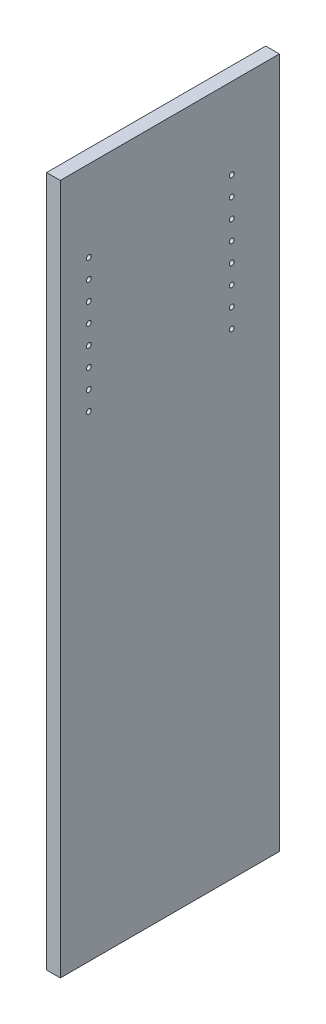
ISO-10303-21;
HEADER;
FILE_DESCRIPTION(('STEP AP214'),'2;1');
FILE_NAME('part.step','',(''),(''),'','','');
FILE_SCHEMA(('AUTOMOTIVE_DESIGN { 1 0 10303 214 1 1 1 1 }'));
ENDSEC;
DATA;
#1=APPLICATION_CONTEXT('core data for automotive mechanical design processes');
#2=APPLICATION_PROTOCOL_DEFINITION('international standard','automotive_design',2000,#1);
#3=PRODUCT_CONTEXT('',#1,'mechanical');
#4=PRODUCT('Part','Part','',(#3));
#5=PRODUCT_RELATED_PRODUCT_CATEGORY('part','',(#4));
#6=PRODUCT_DEFINITION_FORMATION('','',#4);
#7=PRODUCT_DEFINITION_CONTEXT('part definition',#1,'design');
#8=PRODUCT_DEFINITION('design','',#6,#7);
#9=PRODUCT_DEFINITION_SHAPE('','',#8);
#10=(LENGTH_UNIT() NAMED_UNIT(*) SI_UNIT(.MILLI.,.METRE.));
#11=(NAMED_UNIT(*) PLANE_ANGLE_UNIT() SI_UNIT($,.RADIAN.));
#12=(NAMED_UNIT(*) SI_UNIT($,.STERADIAN.) SOLID_ANGLE_UNIT());
#13=UNCERTAINTY_MEASURE_WITH_UNIT(LENGTH_MEASURE(1.E-05),#10,'distance_accuracy_value','');
#14=(GEOMETRIC_REPRESENTATION_CONTEXT(3) GLOBAL_UNCERTAINTY_ASSIGNED_CONTEXT((#13)) GLOBAL_UNIT_ASSIGNED_CONTEXT((#10,
#11,#12)) REPRESENTATION_CONTEXT('',''));
#15=CARTESIAN_POINT('',(0.,0.,0.));
#16=DIRECTION('',(0.,0.,1.));
#17=DIRECTION('',(1.,0.,0.));
#18=AXIS2_PLACEMENT_3D('',#15,#16,#17);
#19=CARTESIAN_POINT('',(18.25625,-460.375,-146.05));
#20=DIRECTION('',(0.,0.,1.));
#21=DIRECTION('',(1.,0.,0.));
#22=AXIS2_PLACEMENT_3D('',#19,#20,#21);
#23=PLANE('',#22);
#24=DIRECTION('',(0.,1.,0.));
#25=VECTOR('',#24,1.);
#26=CARTESIAN_POINT('',(0.,-460.375,-146.05));
#27=LINE('',#26,#25);
#28=CARTESIAN_POINT('',(0.,-460.375,-146.05));
#29=VERTEX_POINT('',#28);
#30=CARTESIAN_POINT('',(0.,460.375,-146.05));
#31=VERTEX_POINT('',#30);
#32=EDGE_CURVE('E107',#29,#31,#27,.T.);
#33=ORIENTED_EDGE('',*,*,#32,.T.);
#34=DIRECTION('',(-1.,0.,0.));
#35=VECTOR('',#34,1.);
#36=CARTESIAN_POINT('',(18.25625,460.375,-146.05));
#37=LINE('',#36,#35);
#38=CARTESIAN_POINT('',(18.25625,460.375,-146.05));
#39=VERTEX_POINT('',#38);
#40=EDGE_CURVE('E11',#39,#31,#37,.T.);
#41=ORIENTED_EDGE('',*,*,#40,.F.);
#42=DIRECTION('',(0.,1.,0.));
#43=VECTOR('',#42,1.);
#44=CARTESIAN_POINT('',(18.25625,-460.375,-146.05));
#45=LINE('',#44,#43);
#46=CARTESIAN_POINT('',(18.25625,-460.375,-146.05));
#47=VERTEX_POINT('',#46);
#48=EDGE_CURVE('E91',#47,#39,#45,.T.);
#49=ORIENTED_EDGE('',*,*,#48,.F.);
#50=DIRECTION('',(-1.,0.,0.));
#51=VECTOR('',#50,1.);
#52=CARTESIAN_POINT('',(18.25625,-460.375,-146.05));
#53=LINE('',#52,#51);
#54=EDGE_CURVE('E103',#47,#29,#53,.T.);
#55=ORIENTED_EDGE('',*,*,#54,.T.);
#56=EDGE_LOOP('',(#33,#41,#49,#55));
#57=FACE_BOUND('',#56,.T.);
#58=ADVANCED_FACE('F39',(#57),#23,.F.);
#59=CARTESIAN_POINT('',(18.25625,460.375,146.05));
#60=DIRECTION('',(0.,-1.,0.));
#61=DIRECTION('',(0.,0.,-1.));
#62=AXIS2_PLACEMENT_3D('',#59,#60,#61);
#63=PLANE('',#62);
#64=DIRECTION('',(0.,0.,1.));
#65=VECTOR('',#64,1.);
#66=CARTESIAN_POINT('',(0.,460.375,146.05));
#67=LINE('',#66,#65);
#68=CARTESIAN_POINT('',(0.,460.375,146.05));
#69=VERTEX_POINT('',#68);
#70=EDGE_CURVE('E96',#31,#69,#67,.T.);
#71=ORIENTED_EDGE('',*,*,#70,.T.);
#72=DIRECTION('',(-1.,0.,0.));
#73=VECTOR('',#72,1.);
#74=CARTESIAN_POINT('',(18.25625,460.375,146.05));
#75=LINE('',#74,#73);
#76=CARTESIAN_POINT('',(18.25625,460.375,146.05));
#77=VERTEX_POINT('',#76);
#78=EDGE_CURVE('E48',#77,#69,#75,.T.);
#79=ORIENTED_EDGE('',*,*,#78,.F.);
#80=DIRECTION('',(0.,0.,1.));
#81=VECTOR('',#80,1.);
#82=CARTESIAN_POINT('',(18.25625,460.375,146.05));
#83=LINE('',#82,#81);
#84=EDGE_CURVE('E86',#39,#77,#83,.T.);
#85=ORIENTED_EDGE('',*,*,#84,.F.);
#86=ORIENTED_EDGE('',*,*,#40,.T.);
#87=EDGE_LOOP('',(#71,#79,#85,#86));
#88=FACE_BOUND('',#87,.T.);
#89=ADVANCED_FACE('F95',(#88),#63,.F.);
#90=CARTESIAN_POINT('',(18.25625,-460.375,146.05));
#91=DIRECTION('',(0.,0.,-1.));
#92=DIRECTION('',(-1.,0.,0.));
#93=AXIS2_PLACEMENT_3D('',#90,#91,#92);
#94=PLANE('',#93);
#95=DIRECTION('',(0.,-1.,0.));
#96=VECTOR('',#95,1.);
#97=CARTESIAN_POINT('',(0.,-460.375,146.05));
#98=LINE('',#97,#96);
#99=CARTESIAN_POINT('',(0.,-460.375,146.05));
#100=VERTEX_POINT('',#99);
#101=EDGE_CURVE('E73',#69,#100,#98,.T.);
#102=ORIENTED_EDGE('',*,*,#101,.T.);
#103=DIRECTION('',(-1.,0.,0.));
#104=VECTOR('',#103,1.);
#105=CARTESIAN_POINT('',(18.25625,-460.375,146.05));
#106=LINE('',#105,#104);
#107=CARTESIAN_POINT('',(18.25625,-460.375,146.05));
#108=VERTEX_POINT('',#107);
#109=EDGE_CURVE('E98',#108,#100,#106,.T.);
#110=ORIENTED_EDGE('',*,*,#109,.F.);
#111=DIRECTION('',(0.,-1.,0.));
#112=VECTOR('',#111,1.);
#113=CARTESIAN_POINT('',(18.25625,-460.375,146.05));
#114=LINE('',#113,#112);
#115=EDGE_CURVE('E89',#77,#108,#114,.T.);
#116=ORIENTED_EDGE('',*,*,#115,.F.);
#117=ORIENTED_EDGE('',*,*,#78,.T.);
#118=EDGE_LOOP('',(#102,#110,#116,#117));
#119=FACE_BOUND('',#118,.T.);
#120=ADVANCED_FACE('F99',(#119),#94,.F.);
#121=CARTESIAN_POINT('',(18.25625,-460.375,146.05));
#122=DIRECTION('',(0.,1.,0.));
#123=DIRECTION('',(0.,0.,1.));
#124=AXIS2_PLACEMENT_3D('',#121,#122,#123);
#125=PLANE('',#124);
#126=DIRECTION('',(0.,0.,-1.));
#127=VECTOR('',#126,1.);
#128=CARTESIAN_POINT('',(0.,-460.375,146.05));
#129=LINE('',#128,#127);
#130=EDGE_CURVE('E79',#100,#29,#129,.T.);
#131=ORIENTED_EDGE('',*,*,#130,.T.);
#132=ORIENTED_EDGE('',*,*,#54,.F.);
#133=DIRECTION('',(0.,0.,-1.));
#134=VECTOR('',#133,1.);
#135=CARTESIAN_POINT('',(18.25625,-460.375,146.05));
#136=LINE('',#135,#134);
#137=EDGE_CURVE('E56',#108,#47,#136,.T.);
#138=ORIENTED_EDGE('',*,*,#137,.F.);
#139=ORIENTED_EDGE('',*,*,#109,.T.);
#140=EDGE_LOOP('',(#131,#132,#138,#139));
#141=FACE_BOUND('',#140,.T.);
#142=ADVANCED_FACE('F121',(#141),#125,.F.);
#143=CARTESIAN_POINT('',(18.25625,0.,0.));
#144=DIRECTION('',(-1.,0.,0.));
#145=DIRECTION('',(0.,0.,1.));
#146=AXIS2_PLACEMENT_3D('',#143,#144,#145);
#147=PLANE('',#146);
#148=CARTESIAN_POINT('',(18.25625,327.025,107.95));
#149=DIRECTION('',(1.,0.,0.));
#150=DIRECTION('',(0.,0.,-1.));
#151=AXIS2_PLACEMENT_3D('',#148,#149,#150);
#152=CIRCLE('',#151,3.175);
#153=CARTESIAN_POINT('',(18.25625,327.025,104.775));
#154=VERTEX_POINT('',#153);
#155=EDGE_CURVE('E193',#154,#154,#152,.T.);
#156=ORIENTED_EDGE('',*,*,#155,.F.);
#157=EDGE_LOOP('',(#156));
#158=FACE_BOUND('',#157,.T.);
#159=CARTESIAN_POINT('',(18.25625,301.625,107.949999999999));
#160=DIRECTION('',(1.,0.,0.));
#161=DIRECTION('',(0.,0.,-1.));
#162=AXIS2_PLACEMENT_3D('',#159,#160,#161);
#163=CIRCLE('',#162,3.175);
#164=CARTESIAN_POINT('',(18.25625,301.625,104.774999999999));
#165=VERTEX_POINT('',#164);
#166=EDGE_CURVE('E185',#165,#165,#163,.T.);
#167=ORIENTED_EDGE('',*,*,#166,.F.);
#168=EDGE_LOOP('',(#167));
#169=FACE_BOUND('',#168,.T.);
#170=CARTESIAN_POINT('',(18.25625,276.225,107.949999999999));
#171=DIRECTION('',(1.,0.,0.));
#172=DIRECTION('',(0.,0.,-1.));
#173=AXIS2_PLACEMENT_3D('',#170,#171,#172);
#174=CIRCLE('',#173,3.175);
#175=CARTESIAN_POINT('',(18.25625,276.225,104.774999999999));
#176=VERTEX_POINT('',#175);
#177=EDGE_CURVE('E177',#176,#176,#174,.T.);
#178=ORIENTED_EDGE('',*,*,#177,.F.);
#179=EDGE_LOOP('',(#178));
#180=FACE_BOUND('',#179,.T.);
#181=CARTESIAN_POINT('',(18.25625,250.825,107.949999999999));
#182=DIRECTION('',(1.,0.,0.));
#183=DIRECTION('',(0.,0.,-1.));
#184=AXIS2_PLACEMENT_3D('',#181,#182,#183);
#185=CIRCLE('',#184,3.175);
#186=CARTESIAN_POINT('',(18.25625,250.825,104.774999999999));
#187=VERTEX_POINT('',#186);
#188=EDGE_CURVE('E169',#187,#187,#185,.T.);
#189=ORIENTED_EDGE('',*,*,#188,.F.);
#190=EDGE_LOOP('',(#189));
#191=FACE_BOUND('',#190,.T.);
#192=CARTESIAN_POINT('',(18.25625,225.425,107.949999999999));
#193=DIRECTION('',(1.,0.,0.));
#194=DIRECTION('',(0.,0.,-1.));
#195=AXIS2_PLACEMENT_3D('',#192,#193,#194);
#196=CIRCLE('',#195,3.175);
#197=CARTESIAN_POINT('',(18.25625,225.425,104.774999999999));
#198=VERTEX_POINT('',#197);
#199=EDGE_CURVE('E161',#198,#198,#196,.T.);
#200=ORIENTED_EDGE('',*,*,#199,.F.);
#201=EDGE_LOOP('',(#200));
#202=FACE_BOUND('',#201,.T.);
#203=CARTESIAN_POINT('',(18.25625,200.025,107.949999999998));
#204=DIRECTION('',(1.,0.,0.));
#205=DIRECTION('',(0.,0.,-1.));
#206=AXIS2_PLACEMENT_3D('',#203,#204,#205);
#207=CIRCLE('',#206,3.175);
#208=CARTESIAN_POINT('',(18.25625,200.025,104.774999999998));
#209=VERTEX_POINT('',#208);
#210=EDGE_CURVE('E153',#209,#209,#207,.T.);
#211=ORIENTED_EDGE('',*,*,#210,.F.);
#212=EDGE_LOOP('',(#211));
#213=FACE_BOUND('',#212,.T.);
#214=CARTESIAN_POINT('',(18.25625,174.625,107.949999999998));
#215=DIRECTION('',(1.,0.,0.));
#216=DIRECTION('',(0.,0.,-1.));
#217=AXIS2_PLACEMENT_3D('',#214,#215,#216);
#218=CIRCLE('',#217,3.175);
#219=CARTESIAN_POINT('',(18.25625,174.625,104.774999999998));
#220=VERTEX_POINT('',#219);
#221=EDGE_CURVE('E145',#220,#220,#218,.T.);
#222=ORIENTED_EDGE('',*,*,#221,.F.);
#223=EDGE_LOOP('',(#222));
#224=FACE_BOUND('',#223,.T.);
#225=CARTESIAN_POINT('',(18.25625,174.625,-82.5499999999981));
#226=DIRECTION('',(1.,0.,0.));
#227=DIRECTION('',(0.,0.,1.));
#228=AXIS2_PLACEMENT_3D('',#225,#226,#227);
#229=CIRCLE('',#228,3.175);
#230=CARTESIAN_POINT('',(18.25625,174.625,-79.3749999999981));
#231=VERTEX_POINT('',#230);
#232=EDGE_CURVE('E136',#231,#231,#229,.T.);
#233=ORIENTED_EDGE('',*,*,#232,.F.);
#234=EDGE_LOOP('',(#233));
#235=FACE_BOUND('',#234,.T.);
#236=CARTESIAN_POINT('',(18.25625,200.025,-82.5499999999983));
#237=DIRECTION('',(1.,0.,0.));
#238=DIRECTION('',(0.,0.,1.));
#239=AXIS2_PLACEMENT_3D('',#236,#237,#238);
#240=CIRCLE('',#239,3.175);
#241=CARTESIAN_POINT('',(18.25625,200.025,-79.3749999999983));
#242=VERTEX_POINT('',#241);
#243=EDGE_CURVE('E248',#242,#242,#240,.T.);
#244=ORIENTED_EDGE('',*,*,#243,.F.);
#245=EDGE_LOOP('',(#244));
#246=FACE_BOUND('',#245,.T.);
#247=CARTESIAN_POINT('',(18.25625,225.425,-82.5499999999986));
#248=DIRECTION('',(1.,0.,0.));
#249=DIRECTION('',(0.,0.,1.));
#250=AXIS2_PLACEMENT_3D('',#247,#248,#249);
#251=CIRCLE('',#250,3.175);
#252=CARTESIAN_POINT('',(18.25625,225.425,-79.3749999999986));
#253=VERTEX_POINT('',#252);
#254=EDGE_CURVE('E240',#253,#253,#251,.T.);
#255=ORIENTED_EDGE('',*,*,#254,.F.);
#256=EDGE_LOOP('',(#255));
#257=FACE_BOUND('',#256,.T.);
#258=CARTESIAN_POINT('',(18.25625,250.825,-82.5499999999988));
#259=DIRECTION('',(1.,0.,0.));
#260=DIRECTION('',(0.,0.,1.));
#261=AXIS2_PLACEMENT_3D('',#258,#259,#260);
#262=CIRCLE('',#261,3.175);
#263=CARTESIAN_POINT('',(18.25625,250.825,-79.3749999999988));
#264=VERTEX_POINT('',#263);
#265=EDGE_CURVE('E232',#264,#264,#262,.T.);
#266=ORIENTED_EDGE('',*,*,#265,.F.);
#267=EDGE_LOOP('',(#266));
#268=FACE_BOUND('',#267,.T.);
#269=CARTESIAN_POINT('',(18.25625,276.225,-82.5499999999991));
#270=DIRECTION('',(1.,0.,0.));
#271=DIRECTION('',(0.,0.,1.));
#272=AXIS2_PLACEMENT_3D('',#269,#270,#271);
#273=CIRCLE('',#272,3.175);
#274=CARTESIAN_POINT('',(18.25625,276.225,-79.3749999999991));
#275=VERTEX_POINT('',#274);
#276=EDGE_CURVE('E224',#275,#275,#273,.T.);
#277=ORIENTED_EDGE('',*,*,#276,.F.);
#278=EDGE_LOOP('',(#277));
#279=FACE_BOUND('',#278,.T.);
#280=CARTESIAN_POINT('',(18.25625,301.625,-82.5499999999993));
#281=DIRECTION('',(1.,0.,0.));
#282=DIRECTION('',(0.,0.,1.));
#283=AXIS2_PLACEMENT_3D('',#280,#281,#282);
#284=CIRCLE('',#283,3.175);
#285=CARTESIAN_POINT('',(18.25625,301.625,-79.3749999999993));
#286=VERTEX_POINT('',#285);
#287=EDGE_CURVE('E216',#286,#286,#284,.T.);
#288=ORIENTED_EDGE('',*,*,#287,.F.);
#289=EDGE_LOOP('',(#288));
#290=FACE_BOUND('',#289,.T.);
#291=CARTESIAN_POINT('',(18.25625,327.025,-82.5499999999996));
#292=DIRECTION('',(1.,0.,0.));
#293=DIRECTION('',(0.,0.,1.));
#294=AXIS2_PLACEMENT_3D('',#291,#292,#293);
#295=CIRCLE('',#294,3.175);
#296=CARTESIAN_POINT('',(18.25625,327.025,-79.3749999999996));
#297=VERTEX_POINT('',#296);
#298=EDGE_CURVE('E208',#297,#297,#295,.T.);
#299=ORIENTED_EDGE('',*,*,#298,.F.);
#300=EDGE_LOOP('',(#299));
#301=FACE_BOUND('',#300,.T.);
#302=CARTESIAN_POINT('',(18.25625,352.425,-82.5499999999999));
#303=DIRECTION('',(1.,0.,0.));
#304=DIRECTION('',(0.,0.,1.));
#305=AXIS2_PLACEMENT_3D('',#302,#303,#304);
#306=CIRCLE('',#305,3.175);
#307=CARTESIAN_POINT('',(18.25625,352.425,-79.3749999999999));
#308=VERTEX_POINT('',#307);
#309=EDGE_CURVE('E200',#308,#308,#306,.T.);
#310=ORIENTED_EDGE('',*,*,#309,.F.);
#311=EDGE_LOOP('',(#310));
#312=FACE_BOUND('',#311,.T.);
#313=CARTESIAN_POINT('',(18.25625,352.425,107.95));
#314=DIRECTION('',(1.,0.,0.));
#315=DIRECTION('',(0.,0.,-1.));
#316=AXIS2_PLACEMENT_3D('',#313,#314,#315);
#317=CIRCLE('',#316,3.175);
#318=CARTESIAN_POINT('',(18.25625,352.425,104.775));
#319=VERTEX_POINT('',#318);
#320=EDGE_CURVE('E128',#319,#319,#317,.T.);
#321=ORIENTED_EDGE('',*,*,#320,.F.);
#322=EDGE_LOOP('',(#321));
#323=FACE_BOUND('',#322,.T.);
#324=ORIENTED_EDGE('',*,*,#48,.T.);
#325=ORIENTED_EDGE('',*,*,#84,.T.);
#326=ORIENTED_EDGE('',*,*,#115,.T.);
#327=ORIENTED_EDGE('',*,*,#137,.T.);
#328=EDGE_LOOP('',(#324,#325,#326,#327));
#329=FACE_BOUND('',#328,.T.);
#330=ADVANCED_FACE('F87',(#158,#169,#180,#191,#202,#213,#224,#235,#246,#257,#268,#279,#290,#301,
#312,#323,#329),#147,.F.);
#331=CARTESIAN_POINT('',(0.,0.,0.));
#332=DIRECTION('',(-1.,0.,0.));
#333=DIRECTION('',(0.,0.,1.));
#334=AXIS2_PLACEMENT_3D('',#331,#332,#333);
#335=PLANE('',#334);
#336=ORIENTED_EDGE('',*,*,#32,.F.);
#337=ORIENTED_EDGE('',*,*,#130,.F.);
#338=ORIENTED_EDGE('',*,*,#101,.F.);
#339=ORIENTED_EDGE('',*,*,#70,.F.);
#340=EDGE_LOOP('',(#336,#337,#338,#339));
#341=FACE_BOUND('',#340,.T.);
#342=ADVANCED_FACE('F124',(#341),#335,.T.);
#343=CARTESIAN_POINT('',(8.73125,352.425,107.95));
#344=DIRECTION('',(1.,0.,0.));
#345=DIRECTION('',(0.,0.,-1.));
#346=AXIS2_PLACEMENT_3D('',#343,#344,#345);
#347=CYLINDRICAL_SURFACE('',#346,3.175);
#348=CARTESIAN_POINT('',(8.73125,352.425,107.95));
#349=DIRECTION('',(1.,0.,0.));
#350=DIRECTION('',(0.,0.,-1.));
#351=AXIS2_PLACEMENT_3D('',#348,#349,#350);
#352=CIRCLE('',#351,3.175);
#353=CARTESIAN_POINT('',(8.73125,352.425,104.775));
#354=VERTEX_POINT('',#353);
#355=EDGE_CURVE('E111',#354,#354,#352,.T.);
#356=ORIENTED_EDGE('',*,*,#355,.F.);
#357=EDGE_LOOP('',(#356));
#358=FACE_BOUND('',#357,.T.);
#359=ORIENTED_EDGE('',*,*,#320,.T.);
#360=EDGE_LOOP('',(#359));
#361=FACE_BOUND('',#360,.T.);
#362=ADVANCED_FACE('F283',(#358,#361),#347,.F.);
#363=CARTESIAN_POINT('',(8.73125,352.425,107.95));
#364=DIRECTION('',(1.,0.,0.));
#365=DIRECTION('',(0.,0.,-1.));
#366=AXIS2_PLACEMENT_3D('',#363,#364,#365);
#367=PLANE('',#366);
#368=ORIENTED_EDGE('',*,*,#355,.T.);
#369=EDGE_LOOP('',(#368));
#370=FACE_BOUND('',#369,.T.);
#371=ADVANCED_FACE('F285',(#370),#367,.T.);
#372=CARTESIAN_POINT('',(8.73125,352.425,-82.5499999999999));
#373=DIRECTION('',(1.,0.,0.));
#374=DIRECTION('',(0.,0.,-1.));
#375=AXIS2_PLACEMENT_3D('',#372,#373,#374);
#376=CYLINDRICAL_SURFACE('',#375,3.175);
#377=CARTESIAN_POINT('',(8.73125,352.425,-82.5499999999999));
#378=DIRECTION('',(1.,0.,0.));
#379=DIRECTION('',(0.,0.,1.));
#380=AXIS2_PLACEMENT_3D('',#377,#378,#379);
#381=CIRCLE('',#380,3.175);
#382=CARTESIAN_POINT('',(8.73125,352.425,-79.3749999999999));
#383=VERTEX_POINT('',#382);
#384=EDGE_CURVE('E204',#383,#383,#381,.T.);
#385=ORIENTED_EDGE('',*,*,#384,.F.);
#386=EDGE_LOOP('',(#385));
#387=FACE_BOUND('',#386,.T.);
#388=ORIENTED_EDGE('',*,*,#309,.T.);
#389=EDGE_LOOP('',(#388));
#390=FACE_BOUND('',#389,.T.);
#391=ADVANCED_FACE('F292',(#387,#390),#376,.F.);
#392=CARTESIAN_POINT('',(8.73125,352.425,-82.5499999999999));
#393=DIRECTION('',(-1.,0.,0.));
#394=DIRECTION('',(0.,0.,1.));
#395=AXIS2_PLACEMENT_3D('',#392,#393,#394);
#396=PLANE('',#395);
#397=ORIENTED_EDGE('',*,*,#384,.T.);
#398=EDGE_LOOP('',(#397));
#399=FACE_BOUND('',#398,.T.);
#400=ADVANCED_FACE('F340',(#399),#396,.F.);
#401=CARTESIAN_POINT('',(8.73125,327.025,-82.5499999999996));
#402=DIRECTION('',(1.,0.,0.));
#403=DIRECTION('',(0.,0.,-1.));
#404=AXIS2_PLACEMENT_3D('',#401,#402,#403);
#405=CYLINDRICAL_SURFACE('',#404,3.175);
#406=CARTESIAN_POINT('',(8.73125,327.025,-82.5499999999996));
#407=DIRECTION('',(1.,0.,0.));
#408=DIRECTION('',(0.,0.,1.));
#409=AXIS2_PLACEMENT_3D('',#406,#407,#408);
#410=CIRCLE('',#409,3.175);
#411=CARTESIAN_POINT('',(8.73125,327.025,-79.3749999999996));
#412=VERTEX_POINT('',#411);
#413=EDGE_CURVE('E212',#412,#412,#410,.T.);
#414=ORIENTED_EDGE('',*,*,#413,.F.);
#415=EDGE_LOOP('',(#414));
#416=FACE_BOUND('',#415,.T.);
#417=ORIENTED_EDGE('',*,*,#298,.T.);
#418=EDGE_LOOP('',(#417));
#419=FACE_BOUND('',#418,.T.);
#420=ADVANCED_FACE('F349',(#416,#419),#405,.F.);
#421=CARTESIAN_POINT('',(8.73125,327.025,-82.5499999999996));
#422=DIRECTION('',(-1.,0.,0.));
#423=DIRECTION('',(0.,0.,1.));
#424=AXIS2_PLACEMENT_3D('',#421,#422,#423);
#425=PLANE('',#424);
#426=ORIENTED_EDGE('',*,*,#413,.T.);
#427=EDGE_LOOP('',(#426));
#428=FACE_BOUND('',#427,.T.);
#429=ADVANCED_FACE('F358',(#428),#425,.F.);
#430=CARTESIAN_POINT('',(8.73125,301.625,-82.5499999999993));
#431=DIRECTION('',(1.,0.,0.));
#432=DIRECTION('',(0.,0.,-1.));
#433=AXIS2_PLACEMENT_3D('',#430,#431,#432);
#434=CYLINDRICAL_SURFACE('',#433,3.175);
#435=CARTESIAN_POINT('',(8.73125,301.625,-82.5499999999993));
#436=DIRECTION('',(1.,0.,0.));
#437=DIRECTION('',(0.,0.,1.));
#438=AXIS2_PLACEMENT_3D('',#435,#436,#437);
#439=CIRCLE('',#438,3.175);
#440=CARTESIAN_POINT('',(8.73125,301.625,-79.3749999999993));
#441=VERTEX_POINT('',#440);
#442=EDGE_CURVE('E220',#441,#441,#439,.T.);
#443=ORIENTED_EDGE('',*,*,#442,.F.);
#444=EDGE_LOOP('',(#443));
#445=FACE_BOUND('',#444,.T.);
#446=ORIENTED_EDGE('',*,*,#287,.T.);
#447=EDGE_LOOP('',(#446));
#448=FACE_BOUND('',#447,.T.);
#449=ADVANCED_FACE('F367',(#445,#448),#434,.F.);
#450=CARTESIAN_POINT('',(8.73125,301.625,-82.5499999999993));
#451=DIRECTION('',(-1.,0.,0.));
#452=DIRECTION('',(0.,0.,1.));
#453=AXIS2_PLACEMENT_3D('',#450,#451,#452);
#454=PLANE('',#453);
#455=ORIENTED_EDGE('',*,*,#442,.T.);
#456=EDGE_LOOP('',(#455));
#457=FACE_BOUND('',#456,.T.);
#458=ADVANCED_FACE('F376',(#457),#454,.F.);
#459=CARTESIAN_POINT('',(8.73125,276.225,-82.5499999999991));
#460=DIRECTION('',(1.,0.,0.));
#461=DIRECTION('',(0.,0.,-1.));
#462=AXIS2_PLACEMENT_3D('',#459,#460,#461);
#463=CYLINDRICAL_SURFACE('',#462,3.175);
#464=CARTESIAN_POINT('',(8.73125,276.225,-82.5499999999991));
#465=DIRECTION('',(1.,0.,0.));
#466=DIRECTION('',(0.,0.,1.));
#467=AXIS2_PLACEMENT_3D('',#464,#465,#466);
#468=CIRCLE('',#467,3.175);
#469=CARTESIAN_POINT('',(8.73125,276.225,-79.3749999999991));
#470=VERTEX_POINT('',#469);
#471=EDGE_CURVE('E228',#470,#470,#468,.T.);
#472=ORIENTED_EDGE('',*,*,#471,.F.);
#473=EDGE_LOOP('',(#472));
#474=FACE_BOUND('',#473,.T.);
#475=ORIENTED_EDGE('',*,*,#276,.T.);
#476=EDGE_LOOP('',(#475));
#477=FACE_BOUND('',#476,.T.);
#478=ADVANCED_FACE('F385',(#474,#477),#463,.F.);
#479=CARTESIAN_POINT('',(8.73125,276.225,-82.5499999999991));
#480=DIRECTION('',(-1.,0.,0.));
#481=DIRECTION('',(0.,0.,1.));
#482=AXIS2_PLACEMENT_3D('',#479,#480,#481);
#483=PLANE('',#482);
#484=ORIENTED_EDGE('',*,*,#471,.T.);
#485=EDGE_LOOP('',(#484));
#486=FACE_BOUND('',#485,.T.);
#487=ADVANCED_FACE('F394',(#486),#483,.F.);
#488=CARTESIAN_POINT('',(8.73125,250.825,-82.5499999999988));
#489=DIRECTION('',(1.,0.,0.));
#490=DIRECTION('',(0.,0.,-1.));
#491=AXIS2_PLACEMENT_3D('',#488,#489,#490);
#492=CYLINDRICAL_SURFACE('',#491,3.175);
#493=CARTESIAN_POINT('',(8.73125,250.825,-82.5499999999988));
#494=DIRECTION('',(1.,0.,0.));
#495=DIRECTION('',(0.,0.,1.));
#496=AXIS2_PLACEMENT_3D('',#493,#494,#495);
#497=CIRCLE('',#496,3.175);
#498=CARTESIAN_POINT('',(8.73125,250.825,-79.3749999999988));
#499=VERTEX_POINT('',#498);
#500=EDGE_CURVE('E236',#499,#499,#497,.T.);
#501=ORIENTED_EDGE('',*,*,#500,.F.);
#502=EDGE_LOOP('',(#501));
#503=FACE_BOUND('',#502,.T.);
#504=ORIENTED_EDGE('',*,*,#265,.T.);
#505=EDGE_LOOP('',(#504));
#506=FACE_BOUND('',#505,.T.);
#507=ADVANCED_FACE('F403',(#503,#506),#492,.F.);
#508=CARTESIAN_POINT('',(8.73125,250.825,-82.5499999999988));
#509=DIRECTION('',(-1.,0.,0.));
#510=DIRECTION('',(0.,0.,1.));
#511=AXIS2_PLACEMENT_3D('',#508,#509,#510);
#512=PLANE('',#511);
#513=ORIENTED_EDGE('',*,*,#500,.T.);
#514=EDGE_LOOP('',(#513));
#515=FACE_BOUND('',#514,.T.);
#516=ADVANCED_FACE('F412',(#515),#512,.F.);
#517=CARTESIAN_POINT('',(8.73125,225.425,-82.5499999999986));
#518=DIRECTION('',(1.,0.,0.));
#519=DIRECTION('',(0.,0.,-1.));
#520=AXIS2_PLACEMENT_3D('',#517,#518,#519);
#521=CYLINDRICAL_SURFACE('',#520,3.175);
#522=CARTESIAN_POINT('',(8.73125,225.425,-82.5499999999986));
#523=DIRECTION('',(1.,0.,0.));
#524=DIRECTION('',(0.,0.,1.));
#525=AXIS2_PLACEMENT_3D('',#522,#523,#524);
#526=CIRCLE('',#525,3.175);
#527=CARTESIAN_POINT('',(8.73125,225.425,-79.3749999999986));
#528=VERTEX_POINT('',#527);
#529=EDGE_CURVE('E244',#528,#528,#526,.T.);
#530=ORIENTED_EDGE('',*,*,#529,.F.);
#531=EDGE_LOOP('',(#530));
#532=FACE_BOUND('',#531,.T.);
#533=ORIENTED_EDGE('',*,*,#254,.T.);
#534=EDGE_LOOP('',(#533));
#535=FACE_BOUND('',#534,.T.);
#536=ADVANCED_FACE('F421',(#532,#535),#521,.F.);
#537=CARTESIAN_POINT('',(8.73125,225.425,-82.5499999999986));
#538=DIRECTION('',(-1.,0.,0.));
#539=DIRECTION('',(0.,0.,1.));
#540=AXIS2_PLACEMENT_3D('',#537,#538,#539);
#541=PLANE('',#540);
#542=ORIENTED_EDGE('',*,*,#529,.T.);
#543=EDGE_LOOP('',(#542));
#544=FACE_BOUND('',#543,.T.);
#545=ADVANCED_FACE('F261',(#544),#541,.F.);
#546=CARTESIAN_POINT('',(8.73125,200.025,-82.5499999999983));
#547=DIRECTION('',(1.,0.,0.));
#548=DIRECTION('',(0.,0.,-1.));
#549=AXIS2_PLACEMENT_3D('',#546,#547,#548);
#550=CYLINDRICAL_SURFACE('',#549,3.175);
#551=CARTESIAN_POINT('',(8.73125,200.025,-82.5499999999983));
#552=DIRECTION('',(1.,0.,0.));
#553=DIRECTION('',(0.,0.,1.));
#554=AXIS2_PLACEMENT_3D('',#551,#552,#553);
#555=CIRCLE('',#554,3.175);
#556=CARTESIAN_POINT('',(8.73125,200.025,-79.3749999999983));
#557=VERTEX_POINT('',#556);
#558=EDGE_CURVE('E141',#557,#557,#555,.T.);
#559=ORIENTED_EDGE('',*,*,#558,.F.);
#560=EDGE_LOOP('',(#559));
#561=FACE_BOUND('',#560,.T.);
#562=ORIENTED_EDGE('',*,*,#243,.T.);
#563=EDGE_LOOP('',(#562));
#564=FACE_BOUND('',#563,.T.);
#565=ADVANCED_FACE('F258',(#561,#564),#550,.F.);
#566=CARTESIAN_POINT('',(8.73125,200.025,-82.5499999999983));
#567=DIRECTION('',(-1.,0.,0.));
#568=DIRECTION('',(0.,0.,1.));
#569=AXIS2_PLACEMENT_3D('',#566,#567,#568);
#570=PLANE('',#569);
#571=ORIENTED_EDGE('',*,*,#558,.T.);
#572=EDGE_LOOP('',(#571));
#573=FACE_BOUND('',#572,.T.);
#574=ADVANCED_FACE('F256',(#573),#570,.F.);
#575=CARTESIAN_POINT('',(8.73125,174.625,-82.5499999999981));
#576=DIRECTION('',(1.,0.,0.));
#577=DIRECTION('',(0.,0.,-1.));
#578=AXIS2_PLACEMENT_3D('',#575,#576,#577);
#579=CYLINDRICAL_SURFACE('',#578,3.175);
#580=CARTESIAN_POINT('',(8.73125,174.625,-82.5499999999981));
#581=DIRECTION('',(1.,0.,0.));
#582=DIRECTION('',(0.,0.,1.));
#583=AXIS2_PLACEMENT_3D('',#580,#581,#582);
#584=CIRCLE('',#583,3.175);
#585=CARTESIAN_POINT('',(8.73125,174.625,-79.3749999999981));
#586=VERTEX_POINT('',#585);
#587=EDGE_CURVE('E140',#586,#586,#584,.T.);
#588=ORIENTED_EDGE('',*,*,#587,.F.);
#589=EDGE_LOOP('',(#588));
#590=FACE_BOUND('',#589,.T.);
#591=ORIENTED_EDGE('',*,*,#232,.T.);
#592=EDGE_LOOP('',(#591));
#593=FACE_BOUND('',#592,.T.);
#594=ADVANCED_FACE('F451',(#590,#593),#579,.F.);
#595=CARTESIAN_POINT('',(8.73125,174.625,-82.5499999999981));
#596=DIRECTION('',(-1.,0.,0.));
#597=DIRECTION('',(0.,0.,1.));
#598=AXIS2_PLACEMENT_3D('',#595,#596,#597);
#599=PLANE('',#598);
#600=ORIENTED_EDGE('',*,*,#587,.T.);
#601=EDGE_LOOP('',(#600));
#602=FACE_BOUND('',#601,.T.);
#603=ADVANCED_FACE('F459',(#602),#599,.F.);
#604=CARTESIAN_POINT('',(8.73125,174.625,107.949999999998));
#605=DIRECTION('',(1.,0.,0.));
#606=DIRECTION('',(0.,0.,-1.));
#607=AXIS2_PLACEMENT_3D('',#604,#605,#606);
#608=CYLINDRICAL_SURFACE('',#607,3.175);
#609=CARTESIAN_POINT('',(8.73125,174.625,107.949999999998));
#610=DIRECTION('',(1.,0.,0.));
#611=DIRECTION('',(0.,0.,-1.));
#612=AXIS2_PLACEMENT_3D('',#609,#610,#611);
#613=CIRCLE('',#612,3.175);
#614=CARTESIAN_POINT('',(8.73125,174.625,104.774999999998));
#615=VERTEX_POINT('',#614);
#616=EDGE_CURVE('E149',#615,#615,#613,.T.);
#617=ORIENTED_EDGE('',*,*,#616,.F.);
#618=EDGE_LOOP('',(#617));
#619=FACE_BOUND('',#618,.T.);
#620=ORIENTED_EDGE('',*,*,#221,.T.);
#621=EDGE_LOOP('',(#620));
#622=FACE_BOUND('',#621,.T.);
#623=ADVANCED_FACE('F468',(#619,#622),#608,.F.);
#624=CARTESIAN_POINT('',(8.73125,174.625,107.949999999998));
#625=DIRECTION('',(1.,0.,0.));
#626=DIRECTION('',(0.,0.,-1.));
#627=AXIS2_PLACEMENT_3D('',#624,#625,#626);
#628=PLANE('',#627);
#629=ORIENTED_EDGE('',*,*,#616,.T.);
#630=EDGE_LOOP('',(#629));
#631=FACE_BOUND('',#630,.T.);
#632=ADVANCED_FACE('F477',(#631),#628,.T.);
#633=CARTESIAN_POINT('',(8.73125,200.025,107.949999999998));
#634=DIRECTION('',(1.,0.,0.));
#635=DIRECTION('',(0.,0.,-1.));
#636=AXIS2_PLACEMENT_3D('',#633,#634,#635);
#637=CYLINDRICAL_SURFACE('',#636,3.175);
#638=CARTESIAN_POINT('',(8.73125,200.025,107.949999999998));
#639=DIRECTION('',(1.,0.,0.));
#640=DIRECTION('',(0.,0.,-1.));
#641=AXIS2_PLACEMENT_3D('',#638,#639,#640);
#642=CIRCLE('',#641,3.175);
#643=CARTESIAN_POINT('',(8.73125,200.025,104.774999999998));
#644=VERTEX_POINT('',#643);
#645=EDGE_CURVE('E157',#644,#644,#642,.T.);
#646=ORIENTED_EDGE('',*,*,#645,.F.);
#647=EDGE_LOOP('',(#646));
#648=FACE_BOUND('',#647,.T.);
#649=ORIENTED_EDGE('',*,*,#210,.T.);
#650=EDGE_LOOP('',(#649));
#651=FACE_BOUND('',#650,.T.);
#652=ADVANCED_FACE('F486',(#648,#651),#637,.F.);
#653=CARTESIAN_POINT('',(8.73125,200.025,107.949999999998));
#654=DIRECTION('',(1.,0.,0.));
#655=DIRECTION('',(0.,0.,-1.));
#656=AXIS2_PLACEMENT_3D('',#653,#654,#655);
#657=PLANE('',#656);
#658=ORIENTED_EDGE('',*,*,#645,.T.);
#659=EDGE_LOOP('',(#658));
#660=FACE_BOUND('',#659,.T.);
#661=ADVANCED_FACE('F495',(#660),#657,.T.);
#662=CARTESIAN_POINT('',(8.73125,225.425,107.949999999999));
#663=DIRECTION('',(1.,0.,0.));
#664=DIRECTION('',(0.,0.,-1.));
#665=AXIS2_PLACEMENT_3D('',#662,#663,#664);
#666=CYLINDRICAL_SURFACE('',#665,3.175);
#667=CARTESIAN_POINT('',(8.73125,225.425,107.949999999999));
#668=DIRECTION('',(1.,0.,0.));
#669=DIRECTION('',(0.,0.,-1.));
#670=AXIS2_PLACEMENT_3D('',#667,#668,#669);
#671=CIRCLE('',#670,3.175);
#672=CARTESIAN_POINT('',(8.73125,225.425,104.774999999999));
#673=VERTEX_POINT('',#672);
#674=EDGE_CURVE('E165',#673,#673,#671,.T.);
#675=ORIENTED_EDGE('',*,*,#674,.F.);
#676=EDGE_LOOP('',(#675));
#677=FACE_BOUND('',#676,.T.);
#678=ORIENTED_EDGE('',*,*,#199,.T.);
#679=EDGE_LOOP('',(#678));
#680=FACE_BOUND('',#679,.T.);
#681=ADVANCED_FACE('F504',(#677,#680),#666,.F.);
#682=CARTESIAN_POINT('',(8.73125,225.425,107.949999999999));
#683=DIRECTION('',(1.,0.,0.));
#684=DIRECTION('',(0.,0.,-1.));
#685=AXIS2_PLACEMENT_3D('',#682,#683,#684);
#686=PLANE('',#685);
#687=ORIENTED_EDGE('',*,*,#674,.T.);
#688=EDGE_LOOP('',(#687));
#689=FACE_BOUND('',#688,.T.);
#690=ADVANCED_FACE('F513',(#689),#686,.T.);
#691=CARTESIAN_POINT('',(8.73125,250.825,107.949999999999));
#692=DIRECTION('',(1.,0.,0.));
#693=DIRECTION('',(0.,0.,-1.));
#694=AXIS2_PLACEMENT_3D('',#691,#692,#693);
#695=CYLINDRICAL_SURFACE('',#694,3.175);
#696=CARTESIAN_POINT('',(8.73125,250.825,107.949999999999));
#697=DIRECTION('',(1.,0.,0.));
#698=DIRECTION('',(0.,0.,-1.));
#699=AXIS2_PLACEMENT_3D('',#696,#697,#698);
#700=CIRCLE('',#699,3.175);
#701=CARTESIAN_POINT('',(8.73125,250.825,104.774999999999));
#702=VERTEX_POINT('',#701);
#703=EDGE_CURVE('E173',#702,#702,#700,.T.);
#704=ORIENTED_EDGE('',*,*,#703,.F.);
#705=EDGE_LOOP('',(#704));
#706=FACE_BOUND('',#705,.T.);
#707=ORIENTED_EDGE('',*,*,#188,.T.);
#708=EDGE_LOOP('',(#707));
#709=FACE_BOUND('',#708,.T.);
#710=ADVANCED_FACE('F522',(#706,#709),#695,.F.);
#711=CARTESIAN_POINT('',(8.73125,250.825,107.949999999999));
#712=DIRECTION('',(1.,0.,0.));
#713=DIRECTION('',(0.,0.,-1.));
#714=AXIS2_PLACEMENT_3D('',#711,#712,#713);
#715=PLANE('',#714);
#716=ORIENTED_EDGE('',*,*,#703,.T.);
#717=EDGE_LOOP('',(#716));
#718=FACE_BOUND('',#717,.T.);
#719=ADVANCED_FACE('F531',(#718),#715,.T.);
#720=CARTESIAN_POINT('',(8.73125,276.225,107.949999999999));
#721=DIRECTION('',(1.,0.,0.));
#722=DIRECTION('',(0.,0.,-1.));
#723=AXIS2_PLACEMENT_3D('',#720,#721,#722);
#724=CYLINDRICAL_SURFACE('',#723,3.175);
#725=CARTESIAN_POINT('',(8.73125,276.225,107.949999999999));
#726=DIRECTION('',(1.,0.,0.));
#727=DIRECTION('',(0.,0.,-1.));
#728=AXIS2_PLACEMENT_3D('',#725,#726,#727);
#729=CIRCLE('',#728,3.175);
#730=CARTESIAN_POINT('',(8.73125,276.225,104.774999999999));
#731=VERTEX_POINT('',#730);
#732=EDGE_CURVE('E181',#731,#731,#729,.T.);
#733=ORIENTED_EDGE('',*,*,#732,.F.);
#734=EDGE_LOOP('',(#733));
#735=FACE_BOUND('',#734,.T.);
#736=ORIENTED_EDGE('',*,*,#177,.T.);
#737=EDGE_LOOP('',(#736));
#738=FACE_BOUND('',#737,.T.);
#739=ADVANCED_FACE('F540',(#735,#738),#724,.F.);
#740=CARTESIAN_POINT('',(8.73125,276.225,107.949999999999));
#741=DIRECTION('',(1.,0.,0.));
#742=DIRECTION('',(0.,0.,-1.));
#743=AXIS2_PLACEMENT_3D('',#740,#741,#742);
#744=PLANE('',#743);
#745=ORIENTED_EDGE('',*,*,#732,.T.);
#746=EDGE_LOOP('',(#745));
#747=FACE_BOUND('',#746,.T.);
#748=ADVANCED_FACE('F549',(#747),#744,.T.);
#749=CARTESIAN_POINT('',(8.73125,301.625,107.949999999999));
#750=DIRECTION('',(1.,0.,0.));
#751=DIRECTION('',(0.,0.,-1.));
#752=AXIS2_PLACEMENT_3D('',#749,#750,#751);
#753=CYLINDRICAL_SURFACE('',#752,3.175);
#754=CARTESIAN_POINT('',(8.73125,301.625,107.949999999999));
#755=DIRECTION('',(1.,0.,0.));
#756=DIRECTION('',(0.,0.,-1.));
#757=AXIS2_PLACEMENT_3D('',#754,#755,#756);
#758=CIRCLE('',#757,3.175);
#759=CARTESIAN_POINT('',(8.73125,301.625,104.774999999999));
#760=VERTEX_POINT('',#759);
#761=EDGE_CURVE('E189',#760,#760,#758,.T.);
#762=ORIENTED_EDGE('',*,*,#761,.F.);
#763=EDGE_LOOP('',(#762));
#764=FACE_BOUND('',#763,.T.);
#765=ORIENTED_EDGE('',*,*,#166,.T.);
#766=EDGE_LOOP('',(#765));
#767=FACE_BOUND('',#766,.T.);
#768=ADVANCED_FACE('F558',(#764,#767),#753,.F.);
#769=CARTESIAN_POINT('',(8.73125,301.625,107.949999999999));
#770=DIRECTION('',(1.,0.,0.));
#771=DIRECTION('',(0.,0.,-1.));
#772=AXIS2_PLACEMENT_3D('',#769,#770,#771);
#773=PLANE('',#772);
#774=ORIENTED_EDGE('',*,*,#761,.T.);
#775=EDGE_LOOP('',(#774));
#776=FACE_BOUND('',#775,.T.);
#777=ADVANCED_FACE('F567',(#776),#773,.T.);
#778=CARTESIAN_POINT('',(8.73125,327.025,107.95));
#779=DIRECTION('',(1.,0.,0.));
#780=DIRECTION('',(0.,0.,-1.));
#781=AXIS2_PLACEMENT_3D('',#778,#779,#780);
#782=CYLINDRICAL_SURFACE('',#781,3.175);
#783=CARTESIAN_POINT('',(8.73125,327.025,107.95));
#784=DIRECTION('',(1.,0.,0.));
#785=DIRECTION('',(0.,0.,-1.));
#786=AXIS2_PLACEMENT_3D('',#783,#784,#785);
#787=CIRCLE('',#786,3.175);
#788=CARTESIAN_POINT('',(8.73125,327.025,104.775));
#789=VERTEX_POINT('',#788);
#790=EDGE_CURVE('E132',#789,#789,#787,.T.);
#791=ORIENTED_EDGE('',*,*,#790,.F.);
#792=EDGE_LOOP('',(#791));
#793=FACE_BOUND('',#792,.T.);
#794=ORIENTED_EDGE('',*,*,#155,.T.);
#795=EDGE_LOOP('',(#794));
#796=FACE_BOUND('',#795,.T.);
#797=ADVANCED_FACE('F576',(#793,#796),#782,.F.);
#798=CARTESIAN_POINT('',(8.73125,327.025,107.95));
#799=DIRECTION('',(1.,0.,0.));
#800=DIRECTION('',(0.,0.,-1.));
#801=AXIS2_PLACEMENT_3D('',#798,#799,#800);
#802=PLANE('',#801);
#803=ORIENTED_EDGE('',*,*,#790,.T.);
#804=EDGE_LOOP('',(#803));
#805=FACE_BOUND('',#804,.T.);
#806=ADVANCED_FACE('F585',(#805),#802,.T.);
#807=CLOSED_SHELL('',(#58,#89,#120,#142,#330,#342,#362,#371,#391,#400,#420,#429,#449,#458,#478,
#487,#507,#516,#536,#545,#565,#574,#594,#603,#623,#632,#652,#661,#681,#690,#710,#719,#739,#748,
#768,#777,#797,#806));
#808=MANIFOLD_SOLID_BREP('B2',#807);
#809=ADVANCED_BREP_SHAPE_REPRESENTATION('',(#18,#808),#14);
#810=SHAPE_DEFINITION_REPRESENTATION(#9,#809);
ENDSEC;
END-ISO-10303-21;
